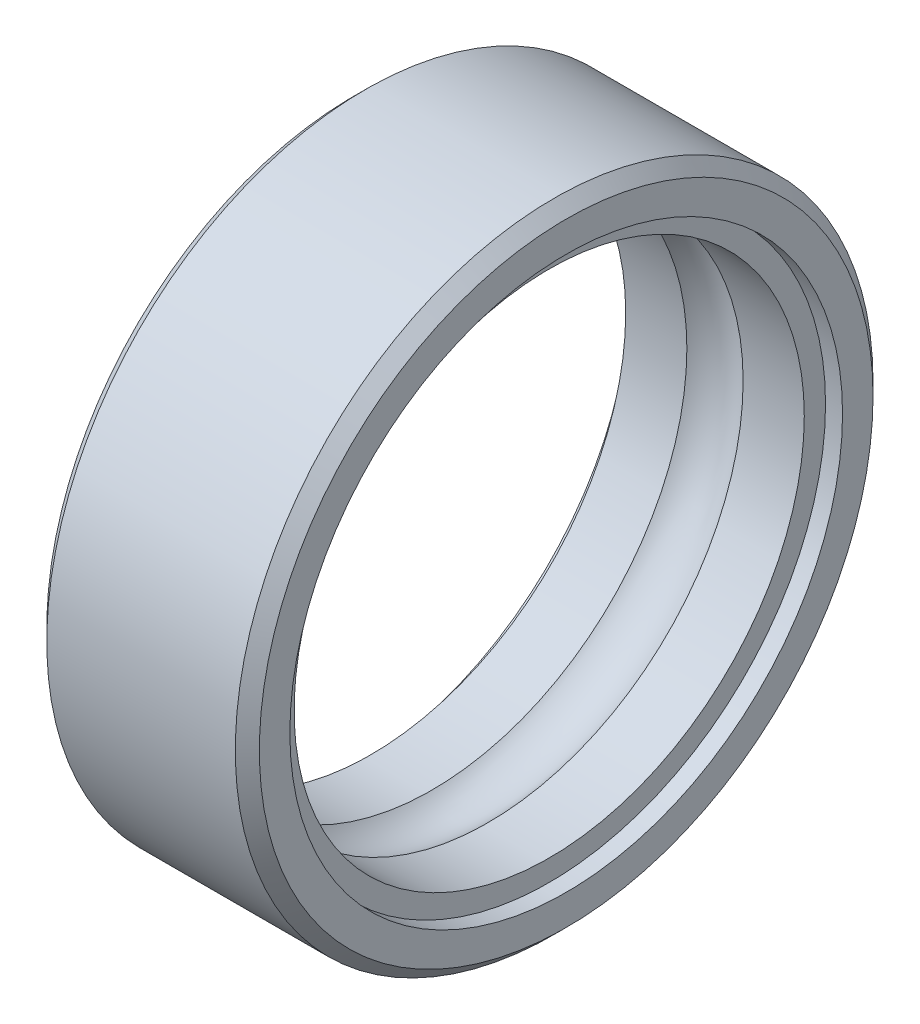
ISO-10303-21;
HEADER;
FILE_DESCRIPTION(('STEP AP214'),'2;1');
FILE_NAME('part.step','',(''),(''),'','','');
FILE_SCHEMA(('AUTOMOTIVE_DESIGN { 1 0 10303 214 1 1 1 1 }'));
ENDSEC;
DATA;
#1=APPLICATION_CONTEXT('core data for automotive mechanical design processes');
#2=APPLICATION_PROTOCOL_DEFINITION('international standard','automotive_design',2000,#1);
#3=PRODUCT_CONTEXT('',#1,'mechanical');
#4=PRODUCT('Part','Part','',(#3));
#5=PRODUCT_RELATED_PRODUCT_CATEGORY('part','',(#4));
#6=PRODUCT_DEFINITION_FORMATION('','',#4);
#7=PRODUCT_DEFINITION_CONTEXT('part definition',#1,'design');
#8=PRODUCT_DEFINITION('design','',#6,#7);
#9=PRODUCT_DEFINITION_SHAPE('','',#8);
#10=(LENGTH_UNIT() NAMED_UNIT(*) SI_UNIT(.MILLI.,.METRE.));
#11=(NAMED_UNIT(*) PLANE_ANGLE_UNIT() SI_UNIT($,.RADIAN.));
#12=(NAMED_UNIT(*) SI_UNIT($,.STERADIAN.) SOLID_ANGLE_UNIT());
#13=UNCERTAINTY_MEASURE_WITH_UNIT(LENGTH_MEASURE(1.E-05),#10,'distance_accuracy_value','');
#14=(GEOMETRIC_REPRESENTATION_CONTEXT(3) GLOBAL_UNCERTAINTY_ASSIGNED_CONTEXT((#13)) GLOBAL_UNIT_ASSIGNED_CONTEXT((#10,
#11,#12)) REPRESENTATION_CONTEXT('',''));
#15=CARTESIAN_POINT('',(0.,0.,0.));
#16=DIRECTION('',(0.,0.,1.));
#17=DIRECTION('',(1.,0.,0.));
#18=AXIS2_PLACEMENT_3D('',#15,#16,#17);
#19=CARTESIAN_POINT('',(0.,7.2171572875254,0.));
#20=DIRECTION('',(-1.,0.,0.));
#21=DIRECTION('',(0.,0.,1.));
#22=AXIS2_PLACEMENT_3D('',#19,#20,#21);
#23=PLANE('',#22);
#24=CARTESIAN_POINT('',(0.,0.,0.));
#25=DIRECTION('',(1.,0.,0.));
#26=DIRECTION('',(0.,0.,-1.));
#27=AXIS2_PLACEMENT_3D('',#24,#25,#26);
#28=CIRCLE('',#27,6.5);
#29=CARTESIAN_POINT('',(0.,0.,-6.5));
#30=VERTEX_POINT('',#29);
#31=EDGE_CURVE('E64',#30,#30,#28,.T.);
#32=ORIENTED_EDGE('',*,*,#31,.T.);
#33=EDGE_LOOP('',(#32));
#34=FACE_BOUND('',#33,.T.);
#35=CARTESIAN_POINT('',(0.,0.,0.));
#36=DIRECTION('',(1.,0.,0.));
#37=DIRECTION('',(0.,0.,-1.));
#38=AXIS2_PLACEMENT_3D('',#35,#36,#37);
#39=CIRCLE('',#38,7.2171572875254);
#40=CARTESIAN_POINT('',(0.,0.,-7.2171572875254));
#41=VERTEX_POINT('',#40);
#42=EDGE_CURVE('E61',#41,#41,#39,.T.);
#43=ORIENTED_EDGE('',*,*,#42,.F.);
#44=EDGE_LOOP('',(#43));
#45=FACE_BOUND('',#44,.T.);
#46=ADVANCED_FACE('F23',(#34,#45),#23,.T.);
#47=CARTESIAN_POINT('',(5.,0.,0.));
#48=DIRECTION('',(1.,0.,0.));
#49=DIRECTION('',(0.,0.,-1.));
#50=AXIS2_PLACEMENT_3D('',#47,#48,#49);
#51=CYLINDRICAL_SURFACE('',#50,6.5);
#52=CARTESIAN_POINT('',(0.4,0.,0.));
#53=DIRECTION('',(1.,0.,0.));
#54=DIRECTION('',(0.,0.,-1.));
#55=AXIS2_PLACEMENT_3D('',#52,#53,#54);
#56=CIRCLE('',#55,6.5);
#57=CARTESIAN_POINT('',(0.4,0.,-6.5));
#58=VERTEX_POINT('',#57);
#59=EDGE_CURVE('E58',#58,#58,#56,.T.);
#60=ORIENTED_EDGE('',*,*,#59,.T.);
#61=EDGE_LOOP('',(#60));
#62=FACE_BOUND('',#61,.T.);
#63=ORIENTED_EDGE('',*,*,#31,.F.);
#64=EDGE_LOOP('',(#63));
#65=FACE_BOUND('',#64,.T.);
#66=ADVANCED_FACE('F70',(#62,#65),#51,.F.);
#67=CARTESIAN_POINT('',(0.282842712474621,0.,0.));
#68=DIRECTION('',(1.,0.,0.));
#69=DIRECTION('',(0.,0.,-1.));
#70=AXIS2_PLACEMENT_3D('',#67,#68,#69);
#71=CONICAL_SURFACE('',#70,7.5,0.785398163397411);
#72=ORIENTED_EDGE('',*,*,#42,.T.);
#73=EDGE_LOOP('',(#72));
#74=FACE_BOUND('',#73,.T.);
#75=CARTESIAN_POINT('',(0.28284271247462,0.,0.));
#76=DIRECTION('',(1.,0.,0.));
#77=DIRECTION('',(0.,0.,-1.));
#78=AXIS2_PLACEMENT_3D('',#75,#76,#77);
#79=CIRCLE('',#78,7.5);
#80=CARTESIAN_POINT('',(0.28284271247462,0.,-7.5));
#81=VERTEX_POINT('',#80);
#82=EDGE_CURVE('E55',#81,#81,#79,.T.);
#83=ORIENTED_EDGE('',*,*,#82,.F.);
#84=EDGE_LOOP('',(#83));
#85=FACE_BOUND('',#84,.T.);
#86=ADVANCED_FACE('F72',(#74,#85),#71,.T.);
#87=CARTESIAN_POINT('',(0.4,6.5,0.));
#88=DIRECTION('',(-1.,0.,0.));
#89=DIRECTION('',(0.,0.,1.));
#90=AXIS2_PLACEMENT_3D('',#87,#88,#89);
#91=PLANE('',#90);
#92=CARTESIAN_POINT('',(0.4,0.,0.));
#93=DIRECTION('',(1.,0.,0.));
#94=DIRECTION('',(0.,0.,-1.));
#95=AXIS2_PLACEMENT_3D('',#92,#93,#94);
#96=CIRCLE('',#95,6.);
#97=CARTESIAN_POINT('',(0.4,0.,-6.));
#98=VERTEX_POINT('',#97);
#99=EDGE_CURVE('E52',#98,#98,#96,.T.);
#100=ORIENTED_EDGE('',*,*,#99,.T.);
#101=EDGE_LOOP('',(#100));
#102=FACE_BOUND('',#101,.T.);
#103=ORIENTED_EDGE('',*,*,#59,.F.);
#104=EDGE_LOOP('',(#103));
#105=FACE_BOUND('',#104,.T.);
#106=ADVANCED_FACE('F80',(#102,#105),#91,.T.);
#107=CARTESIAN_POINT('',(5.,0.,0.));
#108=DIRECTION('',(1.,0.,0.));
#109=DIRECTION('',(0.,0.,-1.));
#110=AXIS2_PLACEMENT_3D('',#107,#108,#109);
#111=CYLINDRICAL_SURFACE('',#110,7.5);
#112=ORIENTED_EDGE('',*,*,#82,.T.);
#113=EDGE_LOOP('',(#112));
#114=FACE_BOUND('',#113,.T.);
#115=CARTESIAN_POINT('',(4.7171572875254,0.,0.));
#116=DIRECTION('',(1.,0.,0.));
#117=DIRECTION('',(0.,0.,-1.));
#118=AXIS2_PLACEMENT_3D('',#115,#116,#117);
#119=CIRCLE('',#118,7.5);
#120=CARTESIAN_POINT('',(4.7171572875254,0.,-7.5));
#121=VERTEX_POINT('',#120);
#122=EDGE_CURVE('E49',#121,#121,#119,.T.);
#123=ORIENTED_EDGE('',*,*,#122,.F.);
#124=EDGE_LOOP('',(#123));
#125=FACE_BOUND('',#124,.T.);
#126=ADVANCED_FACE('F87',(#114,#125),#111,.T.);
#127=CARTESIAN_POINT('',(5.,0.,0.));
#128=DIRECTION('',(1.,0.,0.));
#129=DIRECTION('',(0.,0.,-1.));
#130=AXIS2_PLACEMENT_3D('',#127,#128,#129);
#131=CYLINDRICAL_SURFACE('',#130,6.);
#132=CARTESIAN_POINT('',(1.8385621722339,0.,0.));
#133=DIRECTION('',(1.,0.,0.));
#134=DIRECTION('',(0.,0.,-1.));
#135=AXIS2_PLACEMENT_3D('',#132,#133,#134);
#136=CIRCLE('',#135,6.);
#137=CARTESIAN_POINT('',(1.8385621722339,0.,-6.));
#138=VERTEX_POINT('',#137);
#139=EDGE_CURVE('E46',#138,#138,#136,.T.);
#140=ORIENTED_EDGE('',*,*,#139,.T.);
#141=EDGE_LOOP('',(#140));
#142=FACE_BOUND('',#141,.T.);
#143=ORIENTED_EDGE('',*,*,#99,.F.);
#144=EDGE_LOOP('',(#143));
#145=FACE_BOUND('',#144,.T.);
#146=ADVANCED_FACE('F91',(#142,#145),#131,.F.);
#147=CARTESIAN_POINT('',(5.,0.,0.));
#148=DIRECTION('',(-1.,0.,0.));
#149=DIRECTION('',(0.,0.,1.));
#150=AXIS2_PLACEMENT_3D('',#147,#148,#149);
#151=CONICAL_SURFACE('',#150,7.2171572875254,0.785398163397448);
#152=ORIENTED_EDGE('',*,*,#122,.T.);
#153=EDGE_LOOP('',(#152));
#154=FACE_BOUND('',#153,.T.);
#155=CARTESIAN_POINT('',(5.,0.,0.));
#156=DIRECTION('',(1.,0.,0.));
#157=DIRECTION('',(0.,0.,-1.));
#158=AXIS2_PLACEMENT_3D('',#155,#156,#157);
#159=CIRCLE('',#158,7.2171572875254);
#160=CARTESIAN_POINT('',(5.,0.,-7.2171572875254));
#161=VERTEX_POINT('',#160);
#162=EDGE_CURVE('E43',#161,#161,#159,.T.);
#163=ORIENTED_EDGE('',*,*,#162,.F.);
#164=EDGE_LOOP('',(#163));
#165=FACE_BOUND('',#164,.T.);
#166=ADVANCED_FACE('F95',(#154,#165),#151,.T.);
#167=CARTESIAN_POINT('',(2.5,0.,0.));
#168=DIRECTION('',(1.,0.,0.));
#169=DIRECTION('',(0.,0.,-1.));
#170=AXIS2_PLACEMENT_3D('',#167,#168,#169);
#171=TOROIDAL_SURFACE('',#170,5.25000000000013,0.999999999999873);
#172=ORIENTED_EDGE('',*,*,#139,.F.);
#173=EDGE_LOOP('',(#172));
#174=FACE_BOUND('',#173,.T.);
#175=CARTESIAN_POINT('',(3.1614378277661,0.,0.));
#176=DIRECTION('',(1.,0.,0.));
#177=DIRECTION('',(0.,0.,-1.));
#178=AXIS2_PLACEMENT_3D('',#175,#176,#177);
#179=CIRCLE('',#178,6.);
#180=CARTESIAN_POINT('',(3.1614378277661,0.,-6.));
#181=VERTEX_POINT('',#180);
#182=EDGE_CURVE('E38',#181,#181,#179,.T.);
#183=ORIENTED_EDGE('',*,*,#182,.T.);
#184=EDGE_LOOP('',(#183));
#185=FACE_BOUND('',#184,.T.);
#186=ADVANCED_FACE('F99',(#174,#185),#171,.F.);
#187=CARTESIAN_POINT('',(5.,6.5,0.));
#188=DIRECTION('',(1.,0.,0.));
#189=DIRECTION('',(0.,0.,-1.));
#190=AXIS2_PLACEMENT_3D('',#187,#188,#189);
#191=PLANE('',#190);
#192=ORIENTED_EDGE('',*,*,#162,.T.);
#193=EDGE_LOOP('',(#192));
#194=FACE_BOUND('',#193,.T.);
#195=CARTESIAN_POINT('',(5.,0.,0.));
#196=DIRECTION('',(1.,0.,0.));
#197=DIRECTION('',(0.,0.,-1.));
#198=AXIS2_PLACEMENT_3D('',#195,#196,#197);
#199=CIRCLE('',#198,6.5);
#200=CARTESIAN_POINT('',(5.,0.,-6.5));
#201=VERTEX_POINT('',#200);
#202=EDGE_CURVE('E34',#201,#201,#199,.T.);
#203=ORIENTED_EDGE('',*,*,#202,.F.);
#204=EDGE_LOOP('',(#203));
#205=FACE_BOUND('',#204,.T.);
#206=ADVANCED_FACE('F103',(#194,#205),#191,.T.);
#207=CARTESIAN_POINT('',(5.,0.,0.));
#208=DIRECTION('',(1.,0.,0.));
#209=DIRECTION('',(0.,0.,-1.));
#210=AXIS2_PLACEMENT_3D('',#207,#208,#209);
#211=CYLINDRICAL_SURFACE('',#210,6.);
#212=CARTESIAN_POINT('',(4.6,0.,0.));
#213=DIRECTION('',(1.,0.,0.));
#214=DIRECTION('',(0.,0.,-1.));
#215=AXIS2_PLACEMENT_3D('',#212,#213,#214);
#216=CIRCLE('',#215,6.);
#217=CARTESIAN_POINT('',(4.6,0.,-6.));
#218=VERTEX_POINT('',#217);
#219=EDGE_CURVE('E30',#218,#218,#216,.T.);
#220=ORIENTED_EDGE('',*,*,#219,.T.);
#221=EDGE_LOOP('',(#220));
#222=FACE_BOUND('',#221,.T.);
#223=ORIENTED_EDGE('',*,*,#182,.F.);
#224=EDGE_LOOP('',(#223));
#225=FACE_BOUND('',#224,.T.);
#226=ADVANCED_FACE('F107',(#222,#225),#211,.F.);
#227=CARTESIAN_POINT('',(5.,0.,0.));
#228=DIRECTION('',(1.,0.,0.));
#229=DIRECTION('',(0.,0.,-1.));
#230=AXIS2_PLACEMENT_3D('',#227,#228,#229);
#231=CYLINDRICAL_SURFACE('',#230,6.5);
#232=ORIENTED_EDGE('',*,*,#202,.T.);
#233=EDGE_LOOP('',(#232));
#234=FACE_BOUND('',#233,.T.);
#235=CARTESIAN_POINT('',(4.6,0.,0.));
#236=DIRECTION('',(1.,0.,0.));
#237=DIRECTION('',(0.,0.,-1.));
#238=AXIS2_PLACEMENT_3D('',#235,#236,#237);
#239=CIRCLE('',#238,6.5);
#240=CARTESIAN_POINT('',(4.6,0.,-6.5));
#241=VERTEX_POINT('',#240);
#242=EDGE_CURVE('E12',#241,#241,#239,.T.);
#243=ORIENTED_EDGE('',*,*,#242,.F.);
#244=EDGE_LOOP('',(#243));
#245=FACE_BOUND('',#244,.T.);
#246=ADVANCED_FACE('F110',(#234,#245),#231,.F.);
#247=CARTESIAN_POINT('',(4.6,6.,0.));
#248=DIRECTION('',(1.,0.,0.));
#249=DIRECTION('',(0.,0.,-1.));
#250=AXIS2_PLACEMENT_3D('',#247,#248,#249);
#251=PLANE('',#250);
#252=ORIENTED_EDGE('',*,*,#242,.T.);
#253=EDGE_LOOP('',(#252));
#254=FACE_BOUND('',#253,.T.);
#255=ORIENTED_EDGE('',*,*,#219,.F.);
#256=EDGE_LOOP('',(#255));
#257=FACE_BOUND('',#256,.T.);
#258=ADVANCED_FACE('F25',(#254,#257),#251,.T.);
#259=CLOSED_SHELL('',(#46,#66,#86,#106,#126,#146,#166,#186,#206,#226,#246,#258));
#260=MANIFOLD_SOLID_BREP('B1',#259);
#261=ADVANCED_BREP_SHAPE_REPRESENTATION('',(#18,#260),#14);
#262=SHAPE_DEFINITION_REPRESENTATION(#9,#261);
ENDSEC;
END-ISO-10303-21;
